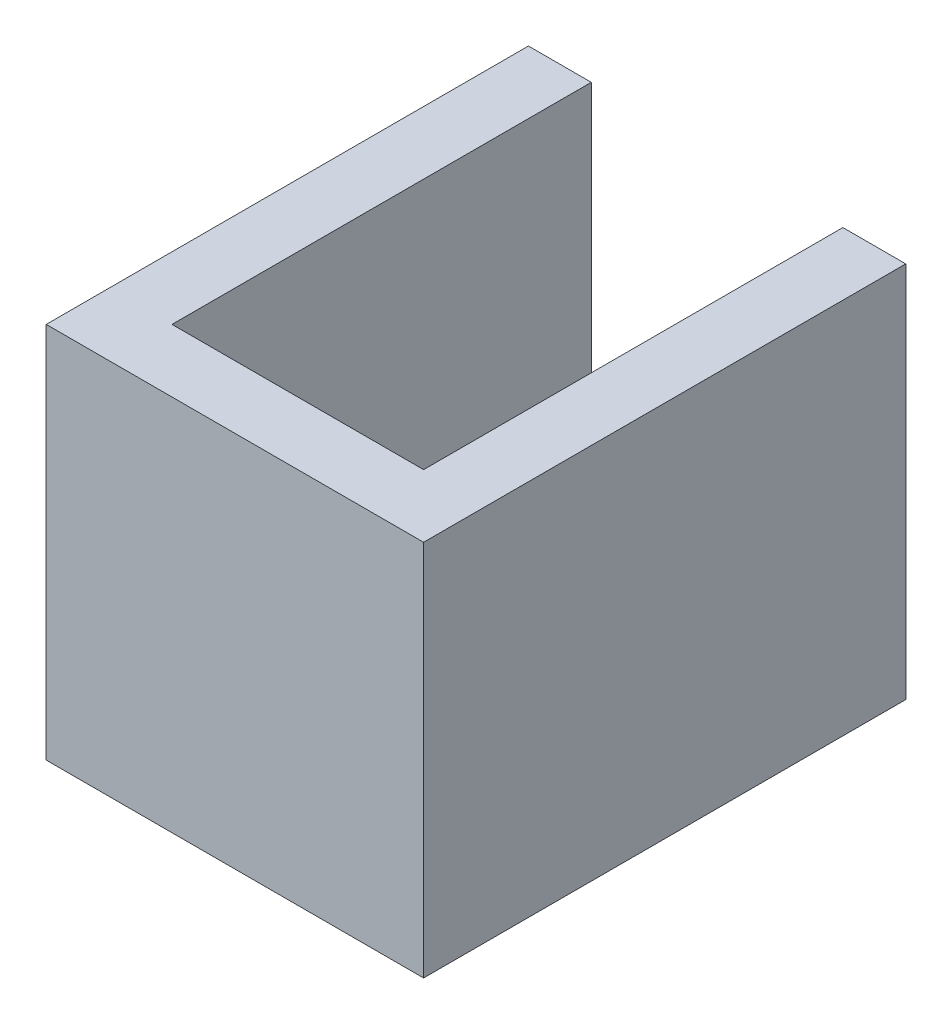
ISO-10303-21;
HEADER;
FILE_DESCRIPTION(('STEP AP214'),'2;1');
FILE_NAME('part.step','',(''),(''),'','','');
FILE_SCHEMA(('AUTOMOTIVE_DESIGN { 1 0 10303 214 1 1 1 1 }'));
ENDSEC;
DATA;
#1=APPLICATION_CONTEXT('core data for automotive mechanical design processes');
#2=APPLICATION_PROTOCOL_DEFINITION('international standard','automotive_design',2000,#1);
#3=PRODUCT_CONTEXT('',#1,'mechanical');
#4=PRODUCT('Part','Part','',(#3));
#5=PRODUCT_RELATED_PRODUCT_CATEGORY('part','',(#4));
#6=PRODUCT_DEFINITION_FORMATION('','',#4);
#7=PRODUCT_DEFINITION_CONTEXT('part definition',#1,'design');
#8=PRODUCT_DEFINITION('design','',#6,#7);
#9=PRODUCT_DEFINITION_SHAPE('','',#8);
#10=(LENGTH_UNIT() NAMED_UNIT(*) SI_UNIT(.MILLI.,.METRE.));
#11=(NAMED_UNIT(*) PLANE_ANGLE_UNIT() SI_UNIT($,.RADIAN.));
#12=(NAMED_UNIT(*) SI_UNIT($,.STERADIAN.) SOLID_ANGLE_UNIT());
#13=UNCERTAINTY_MEASURE_WITH_UNIT(LENGTH_MEASURE(1.E-05),#10,'distance_accuracy_value','');
#14=(GEOMETRIC_REPRESENTATION_CONTEXT(3) GLOBAL_UNCERTAINTY_ASSIGNED_CONTEXT((#13)) GLOBAL_UNIT_ASSIGNED_CONTEXT((#10,
#11,#12)) REPRESENTATION_CONTEXT('',''));
#15=CARTESIAN_POINT('',(0.,0.,0.));
#16=DIRECTION('',(0.,0.,1.));
#17=DIRECTION('',(1.,0.,0.));
#18=AXIS2_PLACEMENT_3D('',#15,#16,#17);
#19=CARTESIAN_POINT('',(15.,18.,0.));
#20=DIRECTION('',(-1.,0.,0.));
#21=DIRECTION('',(0.,0.,1.));
#22=AXIS2_PLACEMENT_3D('',#19,#20,#21);
#23=PLANE('',#22);
#24=DIRECTION('',(0.,0.,-1.));
#25=VECTOR('',#24,1.);
#26=CARTESIAN_POINT('',(15.,0.,0.));
#27=LINE('',#26,#25);
#28=CARTESIAN_POINT('',(15.,0.,-3.));
#29=VERTEX_POINT('',#28);
#30=CARTESIAN_POINT('',(15.,0.,-23.));
#31=VERTEX_POINT('',#30);
#32=EDGE_CURVE('E140',#29,#31,#27,.T.);
#33=ORIENTED_EDGE('',*,*,#32,.F.);
#34=DIRECTION('',(0.,-1.,0.));
#35=VECTOR('',#34,1.);
#36=CARTESIAN_POINT('',(15.,18.,-3.));
#37=LINE('',#36,#35);
#38=CARTESIAN_POINT('',(15.,18.,-3.));
#39=VERTEX_POINT('',#38);
#40=EDGE_CURVE('E11',#39,#29,#37,.T.);
#41=ORIENTED_EDGE('',*,*,#40,.F.);
#42=DIRECTION('',(0.,0.,-1.));
#43=VECTOR('',#42,1.);
#44=CARTESIAN_POINT('',(15.,18.,0.));
#45=LINE('',#44,#43);
#46=CARTESIAN_POINT('',(15.,18.,-23.));
#47=VERTEX_POINT('',#46);
#48=EDGE_CURVE('E195',#39,#47,#45,.T.);
#49=ORIENTED_EDGE('',*,*,#48,.T.);
#50=DIRECTION('',(0.,-1.,0.));
#51=VECTOR('',#50,1.);
#52=CARTESIAN_POINT('',(15.,18.,-23.));
#53=LINE('',#52,#51);
#54=EDGE_CURVE('E58',#47,#31,#53,.T.);
#55=ORIENTED_EDGE('',*,*,#54,.T.);
#56=EDGE_LOOP('',(#33,#41,#49,#55));
#57=FACE_BOUND('',#56,.T.);
#58=ADVANCED_FACE('F41',(#57),#23,.T.);
#59=CARTESIAN_POINT('',(0.,18.,-3.));
#60=DIRECTION('',(0.,0.,-1.));
#61=DIRECTION('',(-1.,0.,0.));
#62=AXIS2_PLACEMENT_3D('',#59,#60,#61);
#63=PLANE('',#62);
#64=DIRECTION('',(1.,0.,0.));
#65=VECTOR('',#64,1.);
#66=CARTESIAN_POINT('',(0.,0.,-3.));
#67=LINE('',#66,#65);
#68=CARTESIAN_POINT('',(3.,0.,-3.));
#69=VERTEX_POINT('',#68);
#70=EDGE_CURVE('E143',#69,#29,#67,.T.);
#71=ORIENTED_EDGE('',*,*,#70,.F.);
#72=DIRECTION('',(0.,-1.,0.));
#73=VECTOR('',#72,1.);
#74=CARTESIAN_POINT('',(3.,18.,-3.));
#75=LINE('',#74,#73);
#76=CARTESIAN_POINT('',(3.,18.,-3.));
#77=VERTEX_POINT('',#76);
#78=EDGE_CURVE('E50',#77,#69,#75,.T.);
#79=ORIENTED_EDGE('',*,*,#78,.F.);
#80=DIRECTION('',(1.,0.,0.));
#81=VECTOR('',#80,1.);
#82=CARTESIAN_POINT('',(0.,18.,-3.));
#83=LINE('',#82,#81);
#84=EDGE_CURVE('E191',#77,#39,#83,.T.);
#85=ORIENTED_EDGE('',*,*,#84,.T.);
#86=ORIENTED_EDGE('',*,*,#40,.T.);
#87=EDGE_LOOP('',(#71,#79,#85,#86));
#88=FACE_BOUND('',#87,.T.);
#89=ADVANCED_FACE('F190',(#88),#63,.T.);
#90=CARTESIAN_POINT('',(3.,18.,0.));
#91=DIRECTION('',(-1.,0.,0.));
#92=DIRECTION('',(0.,0.,1.));
#93=AXIS2_PLACEMENT_3D('',#90,#91,#92);
#94=PLANE('',#93);
#95=DIRECTION('',(0.,0.,-1.));
#96=VECTOR('',#95,1.);
#97=CARTESIAN_POINT('',(3.,0.,0.));
#98=LINE('',#97,#96);
#99=CARTESIAN_POINT('',(3.,0.,-23.));
#100=VERTEX_POINT('',#99);
#101=EDGE_CURVE('E147',#69,#100,#98,.T.);
#102=ORIENTED_EDGE('',*,*,#101,.T.);
#103=DIRECTION('',(0.,-1.,0.));
#104=VECTOR('',#103,1.);
#105=CARTESIAN_POINT('',(3.,18.,-23.));
#106=LINE('',#105,#104);
#107=CARTESIAN_POINT('',(3.,18.,-23.));
#108=VERTEX_POINT('',#107);
#109=EDGE_CURVE('E174',#108,#100,#106,.T.);
#110=ORIENTED_EDGE('',*,*,#109,.F.);
#111=DIRECTION('',(0.,0.,-1.));
#112=VECTOR('',#111,1.);
#113=CARTESIAN_POINT('',(3.,18.,0.));
#114=LINE('',#113,#112);
#115=EDGE_CURVE('E182',#77,#108,#114,.T.);
#116=ORIENTED_EDGE('',*,*,#115,.F.);
#117=ORIENTED_EDGE('',*,*,#78,.T.);
#118=EDGE_LOOP('',(#102,#110,#116,#117));
#119=FACE_BOUND('',#118,.T.);
#120=ADVANCED_FACE('F180',(#119),#94,.F.);
#121=CARTESIAN_POINT('',(0.,18.,-23.));
#122=DIRECTION('',(0.,0.,-1.));
#123=DIRECTION('',(-1.,0.,0.));
#124=AXIS2_PLACEMENT_3D('',#121,#122,#123);
#125=PLANE('',#124);
#126=DIRECTION('',(1.,0.,0.));
#127=VECTOR('',#126,1.);
#128=CARTESIAN_POINT('',(0.,0.,-23.));
#129=LINE('',#128,#127);
#130=CARTESIAN_POINT('',(0.,0.,-23.));
#131=VERTEX_POINT('',#130);
#132=EDGE_CURVE('E151',#131,#100,#129,.T.);
#133=ORIENTED_EDGE('',*,*,#132,.F.);
#134=DIRECTION('',(0.,-1.,0.));
#135=VECTOR('',#134,1.);
#136=CARTESIAN_POINT('',(0.,18.,-23.));
#137=LINE('',#136,#135);
#138=CARTESIAN_POINT('',(0.,18.,-23.));
#139=VERTEX_POINT('',#138);
#140=EDGE_CURVE('E171',#139,#131,#137,.T.);
#141=ORIENTED_EDGE('',*,*,#140,.F.);
#142=DIRECTION('',(1.,0.,0.));
#143=VECTOR('',#142,1.);
#144=CARTESIAN_POINT('',(0.,18.,-23.));
#145=LINE('',#144,#143);
#146=EDGE_CURVE('E137',#139,#108,#145,.T.);
#147=ORIENTED_EDGE('',*,*,#146,.T.);
#148=ORIENTED_EDGE('',*,*,#109,.T.);
#149=EDGE_LOOP('',(#133,#141,#147,#148));
#150=FACE_BOUND('',#149,.T.);
#151=ADVANCED_FACE('F209',(#150),#125,.T.);
#152=CARTESIAN_POINT('',(0.,18.,0.));
#153=DIRECTION('',(-1.,0.,0.));
#154=DIRECTION('',(0.,0.,1.));
#155=AXIS2_PLACEMENT_3D('',#152,#153,#154);
#156=PLANE('',#155);
#157=DIRECTION('',(0.,0.,-1.));
#158=VECTOR('',#157,1.);
#159=CARTESIAN_POINT('',(0.,0.,0.));
#160=LINE('',#159,#158);
#161=CARTESIAN_POINT('',(0.,0.,0.));
#162=VERTEX_POINT('',#161);
#163=EDGE_CURVE('E155',#162,#131,#160,.T.);
#164=ORIENTED_EDGE('',*,*,#163,.F.);
#165=DIRECTION('',(0.,-1.,0.));
#166=VECTOR('',#165,1.);
#167=CARTESIAN_POINT('',(0.,18.,0.));
#168=LINE('',#167,#166);
#169=CARTESIAN_POINT('',(0.,18.,0.));
#170=VERTEX_POINT('',#169);
#171=EDGE_CURVE('E129',#170,#162,#168,.T.);
#172=ORIENTED_EDGE('',*,*,#171,.F.);
#173=DIRECTION('',(0.,0.,-1.));
#174=VECTOR('',#173,1.);
#175=CARTESIAN_POINT('',(0.,18.,0.));
#176=LINE('',#175,#174);
#177=EDGE_CURVE('E117',#170,#139,#176,.T.);
#178=ORIENTED_EDGE('',*,*,#177,.T.);
#179=ORIENTED_EDGE('',*,*,#140,.T.);
#180=EDGE_LOOP('',(#164,#172,#178,#179));
#181=FACE_BOUND('',#180,.T.);
#182=ADVANCED_FACE('F207',(#181),#156,.T.);
#183=CARTESIAN_POINT('',(0.,18.,0.));
#184=DIRECTION('',(0.,0.,-1.));
#185=DIRECTION('',(-1.,0.,0.));
#186=AXIS2_PLACEMENT_3D('',#183,#184,#185);
#187=PLANE('',#186);
#188=DIRECTION('',(1.,0.,0.));
#189=VECTOR('',#188,1.);
#190=CARTESIAN_POINT('',(0.,0.,0.));
#191=LINE('',#190,#189);
#192=CARTESIAN_POINT('',(18.,0.,0.));
#193=VERTEX_POINT('',#192);
#194=EDGE_CURVE('E125',#162,#193,#191,.T.);
#195=ORIENTED_EDGE('',*,*,#194,.T.);
#196=DIRECTION('',(0.,-1.,0.));
#197=VECTOR('',#196,1.);
#198=CARTESIAN_POINT('',(18.,18.,0.));
#199=LINE('',#198,#197);
#200=CARTESIAN_POINT('',(18.,18.,0.));
#201=VERTEX_POINT('',#200);
#202=EDGE_CURVE('E122',#201,#193,#199,.T.);
#203=ORIENTED_EDGE('',*,*,#202,.F.);
#204=DIRECTION('',(1.,0.,0.));
#205=VECTOR('',#204,1.);
#206=CARTESIAN_POINT('',(0.,18.,0.));
#207=LINE('',#206,#205);
#208=EDGE_CURVE('E109',#170,#201,#207,.T.);
#209=ORIENTED_EDGE('',*,*,#208,.F.);
#210=ORIENTED_EDGE('',*,*,#171,.T.);
#211=EDGE_LOOP('',(#195,#203,#209,#210));
#212=FACE_BOUND('',#211,.T.);
#213=ADVANCED_FACE('F123',(#212),#187,.F.);
#214=CARTESIAN_POINT('',(18.,18.,0.));
#215=DIRECTION('',(-1.,0.,0.));
#216=DIRECTION('',(0.,0.,1.));
#217=AXIS2_PLACEMENT_3D('',#214,#215,#216);
#218=PLANE('',#217);
#219=DIRECTION('',(0.,0.,-1.));
#220=VECTOR('',#219,1.);
#221=CARTESIAN_POINT('',(18.,0.,0.));
#222=LINE('',#221,#220);
#223=CARTESIAN_POINT('',(18.,0.,-23.));
#224=VERTEX_POINT('',#223);
#225=EDGE_CURVE('E162',#193,#224,#222,.T.);
#226=ORIENTED_EDGE('',*,*,#225,.T.);
#227=DIRECTION('',(0.,-1.,0.));
#228=VECTOR('',#227,1.);
#229=CARTESIAN_POINT('',(18.,18.,-23.));
#230=LINE('',#229,#228);
#231=CARTESIAN_POINT('',(18.,18.,-23.));
#232=VERTEX_POINT('',#231);
#233=EDGE_CURVE('E84',#232,#224,#230,.T.);
#234=ORIENTED_EDGE('',*,*,#233,.F.);
#235=DIRECTION('',(0.,0.,-1.));
#236=VECTOR('',#235,1.);
#237=CARTESIAN_POINT('',(18.,18.,0.));
#238=LINE('',#237,#236);
#239=EDGE_CURVE('E114',#201,#232,#238,.T.);
#240=ORIENTED_EDGE('',*,*,#239,.F.);
#241=ORIENTED_EDGE('',*,*,#202,.T.);
#242=EDGE_LOOP('',(#226,#234,#240,#241));
#243=FACE_BOUND('',#242,.T.);
#244=ADVANCED_FACE('F131',(#243),#218,.F.);
#245=EDGE_CURVE('E156',#31,#224,#129,.T.);
#246=ORIENTED_EDGE('',*,*,#245,.F.);
#247=ORIENTED_EDGE('',*,*,#54,.F.);
#248=EDGE_CURVE('E133',#47,#232,#145,.T.);
#249=ORIENTED_EDGE('',*,*,#248,.T.);
#250=ORIENTED_EDGE('',*,*,#233,.T.);
#251=EDGE_LOOP('',(#246,#247,#249,#250));
#252=FACE_BOUND('',#251,.T.);
#253=ADVANCED_FACE('F193',(#252),#125,.T.);
#254=CARTESIAN_POINT('',(0.,18.,0.));
#255=DIRECTION('',(0.,1.,0.));
#256=DIRECTION('',(0.,0.,1.));
#257=AXIS2_PLACEMENT_3D('',#254,#255,#256);
#258=PLANE('',#257);
#259=ORIENTED_EDGE('',*,*,#48,.F.);
#260=ORIENTED_EDGE('',*,*,#84,.F.);
#261=ORIENTED_EDGE('',*,*,#115,.T.);
#262=ORIENTED_EDGE('',*,*,#146,.F.);
#263=ORIENTED_EDGE('',*,*,#177,.F.);
#264=ORIENTED_EDGE('',*,*,#208,.T.);
#265=ORIENTED_EDGE('',*,*,#239,.T.);
#266=ORIENTED_EDGE('',*,*,#248,.F.);
#267=EDGE_LOOP('',(#259,#260,#261,#262,#263,#264,#265,#266));
#268=FACE_BOUND('',#267,.T.);
#269=ADVANCED_FACE('F111',(#268),#258,.T.);
#270=CARTESIAN_POINT('',(0.,0.,0.));
#271=DIRECTION('',(0.,1.,0.));
#272=DIRECTION('',(0.,0.,1.));
#273=AXIS2_PLACEMENT_3D('',#270,#271,#272);
#274=PLANE('',#273);
#275=ORIENTED_EDGE('',*,*,#32,.T.);
#276=ORIENTED_EDGE('',*,*,#245,.T.);
#277=ORIENTED_EDGE('',*,*,#225,.F.);
#278=ORIENTED_EDGE('',*,*,#194,.F.);
#279=ORIENTED_EDGE('',*,*,#163,.T.);
#280=ORIENTED_EDGE('',*,*,#132,.T.);
#281=ORIENTED_EDGE('',*,*,#101,.F.);
#282=ORIENTED_EDGE('',*,*,#70,.T.);
#283=EDGE_LOOP('',(#275,#276,#277,#278,#279,#280,#281,#282));
#284=FACE_BOUND('',#283,.T.);
#285=ADVANCED_FACE('F188',(#284),#274,.F.);
#286=CLOSED_SHELL('',(#58,#89,#120,#151,#182,#213,#244,#253,#269,#285));
#287=MANIFOLD_SOLID_BREP('B2',#286);
#288=ADVANCED_BREP_SHAPE_REPRESENTATION('',(#18,#287),#14);
#289=SHAPE_DEFINITION_REPRESENTATION(#9,#288);
ENDSEC;
END-ISO-10303-21;
